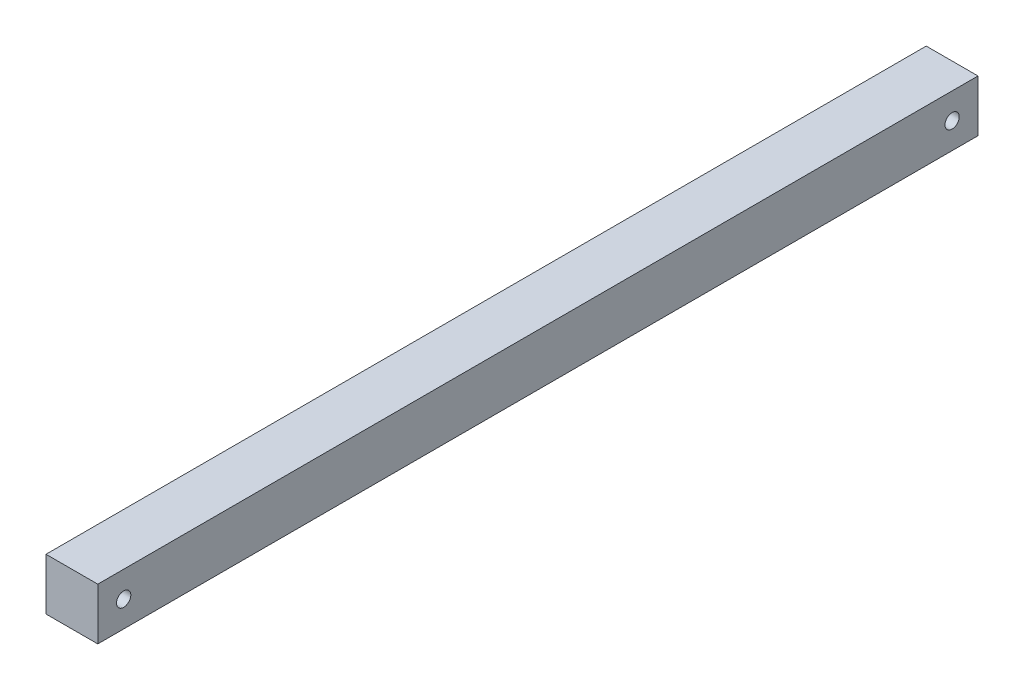
ISO-10303-21;
HEADER;
FILE_DESCRIPTION(('STEP AP214'),'2;1');
FILE_NAME('part.step','',(''),(''),'','','');
FILE_SCHEMA(('AUTOMOTIVE_DESIGN { 1 0 10303 214 1 1 1 1 }'));
ENDSEC;
DATA;
#1=APPLICATION_CONTEXT('core data for automotive mechanical design processes');
#2=APPLICATION_PROTOCOL_DEFINITION('international standard','automotive_design',2000,#1);
#3=PRODUCT_CONTEXT('',#1,'mechanical');
#4=PRODUCT('Part','Part','',(#3));
#5=PRODUCT_RELATED_PRODUCT_CATEGORY('part','',(#4));
#6=PRODUCT_DEFINITION_FORMATION('','',#4);
#7=PRODUCT_DEFINITION_CONTEXT('part definition',#1,'design');
#8=PRODUCT_DEFINITION('design','',#6,#7);
#9=PRODUCT_DEFINITION_SHAPE('','',#8);
#10=(LENGTH_UNIT() NAMED_UNIT(*) SI_UNIT(.MILLI.,.METRE.));
#11=(NAMED_UNIT(*) PLANE_ANGLE_UNIT() SI_UNIT($,.RADIAN.));
#12=(NAMED_UNIT(*) SI_UNIT($,.STERADIAN.) SOLID_ANGLE_UNIT());
#13=UNCERTAINTY_MEASURE_WITH_UNIT(LENGTH_MEASURE(1.E-05),#10,'distance_accuracy_value','');
#14=(GEOMETRIC_REPRESENTATION_CONTEXT(3) GLOBAL_UNCERTAINTY_ASSIGNED_CONTEXT((#13)) GLOBAL_UNIT_ASSIGNED_CONTEXT((#10,
#11,#12)) REPRESENTATION_CONTEXT('',''));
#15=CARTESIAN_POINT('',(0.,0.,0.));
#16=DIRECTION('',(0.,0.,1.));
#17=DIRECTION('',(1.,0.,0.));
#18=AXIS2_PLACEMENT_3D('',#15,#16,#17);
#19=CARTESIAN_POINT('',(12.7,-12.7,431.8));
#20=DIRECTION('',(-1.,0.,0.));
#21=DIRECTION('',(0.,0.,1.));
#22=AXIS2_PLACEMENT_3D('',#19,#20,#21);
#23=PLANE('',#22);
#24=CARTESIAN_POINT('',(12.7,0.,419.1));
#25=DIRECTION('',(-1.,0.,0.));
#26=DIRECTION('',(0.,0.,1.));
#27=AXIS2_PLACEMENT_3D('',#24,#25,#26);
#28=CIRCLE('',#27,3.50000000000002);
#29=CARTESIAN_POINT('',(12.7,0.,422.6));
#30=VERTEX_POINT('',#29);
#31=EDGE_CURVE('E111',#30,#30,#28,.T.);
#32=ORIENTED_EDGE('',*,*,#31,.T.);
#33=EDGE_LOOP('',(#32));
#34=FACE_BOUND('',#33,.T.);
#35=CARTESIAN_POINT('',(12.7,0.,12.7));
#36=DIRECTION('',(-1.,0.,0.));
#37=DIRECTION('',(0.,0.,-1.));
#38=AXIS2_PLACEMENT_3D('',#35,#36,#37);
#39=CIRCLE('',#38,3.50000000000003);
#40=CARTESIAN_POINT('',(12.7,0.,9.19999999999996));
#41=VERTEX_POINT('',#40);
#42=EDGE_CURVE('E132',#41,#41,#39,.T.);
#43=ORIENTED_EDGE('',*,*,#42,.T.);
#44=EDGE_LOOP('',(#43));
#45=FACE_BOUND('',#44,.T.);
#46=DIRECTION('',(0.,1.,0.));
#47=VECTOR('',#46,1.);
#48=CARTESIAN_POINT('',(12.7,-12.7,0.));
#49=LINE('',#48,#47);
#50=CARTESIAN_POINT('',(12.7,-12.7,0.));
#51=VERTEX_POINT('',#50);
#52=CARTESIAN_POINT('',(12.7,12.7,0.));
#53=VERTEX_POINT('',#52);
#54=EDGE_CURVE('E107',#51,#53,#49,.T.);
#55=ORIENTED_EDGE('',*,*,#54,.T.);
#56=DIRECTION('',(0.,0.,-1.));
#57=VECTOR('',#56,1.);
#58=CARTESIAN_POINT('',(12.7,12.7,431.8));
#59=LINE('',#58,#57);
#60=CARTESIAN_POINT('',(12.7,12.7,431.8));
#61=VERTEX_POINT('',#60);
#62=EDGE_CURVE('E11',#61,#53,#59,.T.);
#63=ORIENTED_EDGE('',*,*,#62,.F.);
#64=DIRECTION('',(0.,1.,0.));
#65=VECTOR('',#64,1.);
#66=CARTESIAN_POINT('',(12.7,-12.7,431.8));
#67=LINE('',#66,#65);
#68=CARTESIAN_POINT('',(12.7,-12.7,431.8));
#69=VERTEX_POINT('',#68);
#70=EDGE_CURVE('E91',#69,#61,#67,.T.);
#71=ORIENTED_EDGE('',*,*,#70,.F.);
#72=DIRECTION('',(0.,0.,-1.));
#73=VECTOR('',#72,1.);
#74=CARTESIAN_POINT('',(12.7,-12.7,431.8));
#75=LINE('',#74,#73);
#76=EDGE_CURVE('E103',#69,#51,#75,.T.);
#77=ORIENTED_EDGE('',*,*,#76,.T.);
#78=EDGE_LOOP('',(#55,#63,#71,#77));
#79=FACE_BOUND('',#78,.T.);
#80=ADVANCED_FACE('F39',(#34,#45,#79),#23,.F.);
#81=CARTESIAN_POINT('',(-12.7,12.7,431.8));
#82=DIRECTION('',(0.,-1.,0.));
#83=DIRECTION('',(0.,0.,-1.));
#84=AXIS2_PLACEMENT_3D('',#81,#82,#83);
#85=PLANE('',#84);
#86=DIRECTION('',(-1.,0.,0.));
#87=VECTOR('',#86,1.);
#88=CARTESIAN_POINT('',(-12.7,12.7,0.));
#89=LINE('',#88,#87);
#90=CARTESIAN_POINT('',(-12.7,12.7,0.));
#91=VERTEX_POINT('',#90);
#92=EDGE_CURVE('E96',#53,#91,#89,.T.);
#93=ORIENTED_EDGE('',*,*,#92,.T.);
#94=DIRECTION('',(0.,0.,-1.));
#95=VECTOR('',#94,1.);
#96=CARTESIAN_POINT('',(-12.7,12.7,431.8));
#97=LINE('',#96,#95);
#98=CARTESIAN_POINT('',(-12.7,12.7,431.8));
#99=VERTEX_POINT('',#98);
#100=EDGE_CURVE('E48',#99,#91,#97,.T.);
#101=ORIENTED_EDGE('',*,*,#100,.F.);
#102=DIRECTION('',(-1.,0.,0.));
#103=VECTOR('',#102,1.);
#104=CARTESIAN_POINT('',(-12.7,12.7,431.8));
#105=LINE('',#104,#103);
#106=EDGE_CURVE('E86',#61,#99,#105,.T.);
#107=ORIENTED_EDGE('',*,*,#106,.F.);
#108=ORIENTED_EDGE('',*,*,#62,.T.);
#109=EDGE_LOOP('',(#93,#101,#107,#108));
#110=FACE_BOUND('',#109,.T.);
#111=ADVANCED_FACE('F95',(#110),#85,.F.);
#112=CARTESIAN_POINT('',(-12.7,-12.7,431.8));
#113=DIRECTION('',(1.,0.,0.));
#114=DIRECTION('',(0.,0.,-1.));
#115=AXIS2_PLACEMENT_3D('',#112,#113,#114);
#116=PLANE('',#115);
#117=CARTESIAN_POINT('',(-12.7,0.,419.1));
#118=DIRECTION('',(-1.,0.,0.));
#119=DIRECTION('',(0.,0.,1.));
#120=AXIS2_PLACEMENT_3D('',#117,#118,#119);
#121=CIRCLE('',#120,3.50000000000002);
#122=CARTESIAN_POINT('',(-12.7,0.,422.6));
#123=VERTEX_POINT('',#122);
#124=EDGE_CURVE('E136',#123,#123,#121,.T.);
#125=ORIENTED_EDGE('',*,*,#124,.F.);
#126=EDGE_LOOP('',(#125));
#127=FACE_BOUND('',#126,.T.);
#128=CARTESIAN_POINT('',(-12.7,0.,12.7));
#129=DIRECTION('',(-1.,0.,0.));
#130=DIRECTION('',(0.,0.,-1.));
#131=AXIS2_PLACEMENT_3D('',#128,#129,#130);
#132=CIRCLE('',#131,3.50000000000003);
#133=CARTESIAN_POINT('',(-12.7,0.,9.19999999999996));
#134=VERTEX_POINT('',#133);
#135=EDGE_CURVE('E128',#134,#134,#132,.T.);
#136=ORIENTED_EDGE('',*,*,#135,.F.);
#137=EDGE_LOOP('',(#136));
#138=FACE_BOUND('',#137,.T.);
#139=DIRECTION('',(0.,-1.,0.));
#140=VECTOR('',#139,1.);
#141=CARTESIAN_POINT('',(-12.7,-12.7,0.));
#142=LINE('',#141,#140);
#143=CARTESIAN_POINT('',(-12.7,-12.7,0.));
#144=VERTEX_POINT('',#143);
#145=EDGE_CURVE('E73',#91,#144,#142,.T.);
#146=ORIENTED_EDGE('',*,*,#145,.T.);
#147=DIRECTION('',(0.,0.,-1.));
#148=VECTOR('',#147,1.);
#149=CARTESIAN_POINT('',(-12.7,-12.7,431.8));
#150=LINE('',#149,#148);
#151=CARTESIAN_POINT('',(-12.7,-12.7,431.8));
#152=VERTEX_POINT('',#151);
#153=EDGE_CURVE('E98',#152,#144,#150,.T.);
#154=ORIENTED_EDGE('',*,*,#153,.F.);
#155=DIRECTION('',(0.,-1.,0.));
#156=VECTOR('',#155,1.);
#157=CARTESIAN_POINT('',(-12.7,-12.7,431.8));
#158=LINE('',#157,#156);
#159=EDGE_CURVE('E89',#99,#152,#158,.T.);
#160=ORIENTED_EDGE('',*,*,#159,.F.);
#161=ORIENTED_EDGE('',*,*,#100,.T.);
#162=EDGE_LOOP('',(#146,#154,#160,#161));
#163=FACE_BOUND('',#162,.T.);
#164=ADVANCED_FACE('F99',(#127,#138,#163),#116,.F.);
#165=CARTESIAN_POINT('',(-12.7,-12.7,431.8));
#166=DIRECTION('',(0.,1.,0.));
#167=DIRECTION('',(0.,0.,1.));
#168=AXIS2_PLACEMENT_3D('',#165,#166,#167);
#169=PLANE('',#168);
#170=DIRECTION('',(1.,0.,0.));
#171=VECTOR('',#170,1.);
#172=CARTESIAN_POINT('',(-12.7,-12.7,0.));
#173=LINE('',#172,#171);
#174=EDGE_CURVE('E79',#144,#51,#173,.T.);
#175=ORIENTED_EDGE('',*,*,#174,.T.);
#176=ORIENTED_EDGE('',*,*,#76,.F.);
#177=DIRECTION('',(1.,0.,0.));
#178=VECTOR('',#177,1.);
#179=CARTESIAN_POINT('',(-12.7,-12.7,431.8));
#180=LINE('',#179,#178);
#181=EDGE_CURVE('E56',#152,#69,#180,.T.);
#182=ORIENTED_EDGE('',*,*,#181,.F.);
#183=ORIENTED_EDGE('',*,*,#153,.T.);
#184=EDGE_LOOP('',(#175,#176,#182,#183));
#185=FACE_BOUND('',#184,.T.);
#186=ADVANCED_FACE('F121',(#185),#169,.F.);
#187=CARTESIAN_POINT('',(0.,0.,431.8));
#188=DIRECTION('',(0.,0.,-1.));
#189=DIRECTION('',(-1.,0.,0.));
#190=AXIS2_PLACEMENT_3D('',#187,#188,#189);
#191=PLANE('',#190);
#192=ORIENTED_EDGE('',*,*,#70,.T.);
#193=ORIENTED_EDGE('',*,*,#106,.T.);
#194=ORIENTED_EDGE('',*,*,#159,.T.);
#195=ORIENTED_EDGE('',*,*,#181,.T.);
#196=EDGE_LOOP('',(#192,#193,#194,#195));
#197=FACE_BOUND('',#196,.T.);
#198=ADVANCED_FACE('F87',(#197),#191,.F.);
#199=CARTESIAN_POINT('',(0.,0.,0.));
#200=DIRECTION('',(0.,0.,-1.));
#201=DIRECTION('',(-1.,0.,0.));
#202=AXIS2_PLACEMENT_3D('',#199,#200,#201);
#203=PLANE('',#202);
#204=ORIENTED_EDGE('',*,*,#54,.F.);
#205=ORIENTED_EDGE('',*,*,#174,.F.);
#206=ORIENTED_EDGE('',*,*,#145,.F.);
#207=ORIENTED_EDGE('',*,*,#92,.F.);
#208=EDGE_LOOP('',(#204,#205,#206,#207));
#209=FACE_BOUND('',#208,.T.);
#210=ADVANCED_FACE('F124',(#209),#203,.T.);
#211=CARTESIAN_POINT('',(12.7,0.,12.7));
#212=DIRECTION('',(-1.,0.,0.));
#213=DIRECTION('',(0.,0.,1.));
#214=AXIS2_PLACEMENT_3D('',#211,#212,#213);
#215=CYLINDRICAL_SURFACE('',#214,3.50000000000003);
#216=ORIENTED_EDGE('',*,*,#42,.F.);
#217=EDGE_LOOP('',(#216));
#218=FACE_BOUND('',#217,.T.);
#219=ORIENTED_EDGE('',*,*,#135,.T.);
#220=EDGE_LOOP('',(#219));
#221=FACE_BOUND('',#220,.T.);
#222=ADVANCED_FACE('F149',(#218,#221),#215,.F.);
#223=CARTESIAN_POINT('',(12.7,0.,419.1));
#224=DIRECTION('',(-1.,0.,0.));
#225=DIRECTION('',(0.,0.,1.));
#226=AXIS2_PLACEMENT_3D('',#223,#224,#225);
#227=CYLINDRICAL_SURFACE('',#226,3.50000000000002);
#228=ORIENTED_EDGE('',*,*,#31,.F.);
#229=EDGE_LOOP('',(#228));
#230=FACE_BOUND('',#229,.T.);
#231=ORIENTED_EDGE('',*,*,#124,.T.);
#232=EDGE_LOOP('',(#231));
#233=FACE_BOUND('',#232,.T.);
#234=ADVANCED_FACE('F146',(#230,#233),#227,.F.);
#235=CLOSED_SHELL('',(#80,#111,#164,#186,#198,#210,#222,#234));
#236=MANIFOLD_SOLID_BREP('B2',#235);
#237=ADVANCED_BREP_SHAPE_REPRESENTATION('',(#18,#236),#14);
#238=SHAPE_DEFINITION_REPRESENTATION(#9,#237);
ENDSEC;
END-ISO-10303-21;
